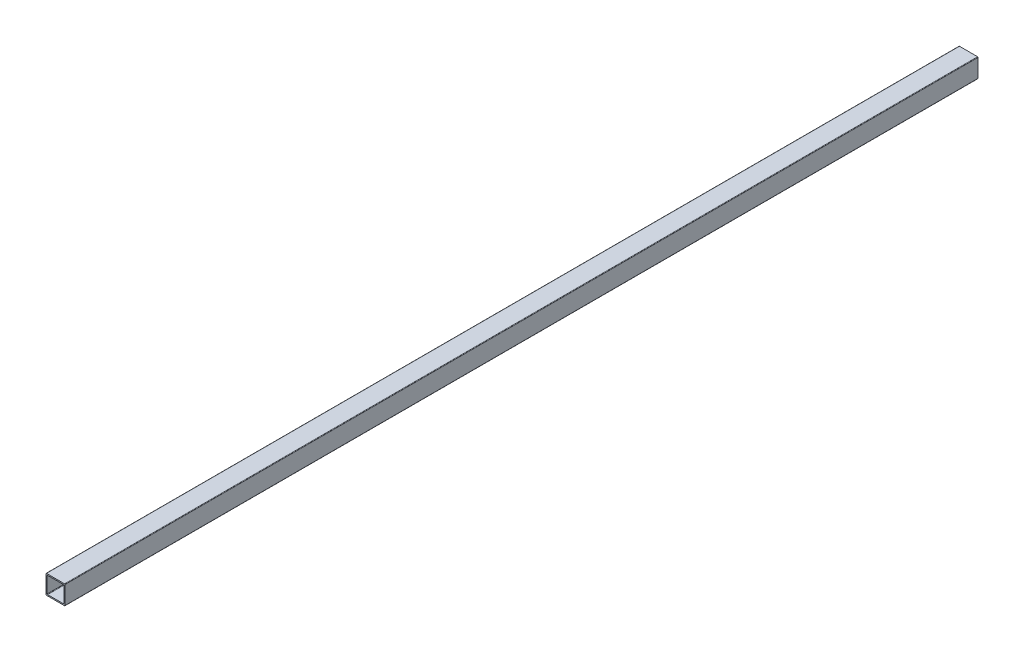
ISO-10303-21;
HEADER;
FILE_DESCRIPTION(('STEP AP214'),'2;1');
FILE_NAME('part.step','',(''),(''),'','','');
FILE_SCHEMA(('AUTOMOTIVE_DESIGN { 1 0 10303 214 1 1 1 1 }'));
ENDSEC;
DATA;
#1=APPLICATION_CONTEXT('core data for automotive mechanical design processes');
#2=APPLICATION_PROTOCOL_DEFINITION('international standard','automotive_design',2000,#1);
#3=PRODUCT_CONTEXT('',#1,'mechanical');
#4=PRODUCT('Part','Part','',(#3));
#5=PRODUCT_RELATED_PRODUCT_CATEGORY('part','',(#4));
#6=PRODUCT_DEFINITION_FORMATION('','',#4);
#7=PRODUCT_DEFINITION_CONTEXT('part definition',#1,'design');
#8=PRODUCT_DEFINITION('design','',#6,#7);
#9=PRODUCT_DEFINITION_SHAPE('','',#8);
#10=(LENGTH_UNIT() NAMED_UNIT(*) SI_UNIT(.MILLI.,.METRE.));
#11=(NAMED_UNIT(*) PLANE_ANGLE_UNIT() SI_UNIT($,.RADIAN.));
#12=(NAMED_UNIT(*) SI_UNIT($,.STERADIAN.) SOLID_ANGLE_UNIT());
#13=UNCERTAINTY_MEASURE_WITH_UNIT(LENGTH_MEASURE(1.E-05),#10,'distance_accuracy_value','');
#14=(GEOMETRIC_REPRESENTATION_CONTEXT(3) GLOBAL_UNCERTAINTY_ASSIGNED_CONTEXT((#13)) GLOBAL_UNIT_ASSIGNED_CONTEXT((#10,
#11,#12)) REPRESENTATION_CONTEXT('',''));
#15=CARTESIAN_POINT('',(0.,0.,0.));
#16=DIRECTION('',(0.,0.,1.));
#17=DIRECTION('',(1.,0.,0.));
#18=AXIS2_PLACEMENT_3D('',#15,#16,#17);
#19=CARTESIAN_POINT('',(12.065,-12.065,1219.2));
#20=DIRECTION('',(0.,0.,-1.));
#21=DIRECTION('',(-1.,0.,0.));
#22=AXIS2_PLACEMENT_3D('',#19,#20,#21);
#23=CYLINDRICAL_SURFACE('',#22,0.634999999999999);
#24=CARTESIAN_POINT('',(12.065,-12.065,0.));
#25=DIRECTION('',(0.,0.,1.));
#26=DIRECTION('',(1.,0.,0.));
#27=AXIS2_PLACEMENT_3D('',#24,#25,#26);
#28=CIRCLE('',#27,0.634999999999999);
#29=CARTESIAN_POINT('',(12.065,-12.7,0.));
#30=VERTEX_POINT('',#29);
#31=CARTESIAN_POINT('',(12.7,-12.065,0.));
#32=VERTEX_POINT('',#31);
#33=EDGE_CURVE('E234',#30,#32,#28,.T.);
#34=ORIENTED_EDGE('',*,*,#33,.T.);
#35=DIRECTION('',(0.,0.,-1.));
#36=VECTOR('',#35,1.);
#37=CARTESIAN_POINT('',(12.7,-12.065,1219.2));
#38=LINE('',#37,#36);
#39=CARTESIAN_POINT('',(12.7,-12.065,1219.2));
#40=VERTEX_POINT('',#39);
#41=EDGE_CURVE('E12',#40,#32,#38,.T.);
#42=ORIENTED_EDGE('',*,*,#41,.F.);
#43=CARTESIAN_POINT('',(12.065,-12.065,1219.2));
#44=DIRECTION('',(0.,0.,1.));
#45=DIRECTION('',(1.,0.,0.));
#46=AXIS2_PLACEMENT_3D('',#43,#44,#45);
#47=CIRCLE('',#46,0.634999999999999);
#48=CARTESIAN_POINT('',(12.065,-12.7,1219.2));
#49=VERTEX_POINT('',#48);
#50=EDGE_CURVE('E312',#49,#40,#47,.T.);
#51=ORIENTED_EDGE('',*,*,#50,.F.);
#52=DIRECTION('',(0.,0.,-1.));
#53=VECTOR('',#52,1.);
#54=CARTESIAN_POINT('',(12.065,-12.7,1219.2));
#55=LINE('',#54,#53);
#56=EDGE_CURVE('E249',#49,#30,#55,.T.);
#57=ORIENTED_EDGE('',*,*,#56,.T.);
#58=EDGE_LOOP('',(#34,#42,#51,#57));
#59=FACE_BOUND('',#58,.T.);
#60=ADVANCED_FACE('F62',(#59),#23,.T.);
#61=CARTESIAN_POINT('',(12.7,-12.065,1219.2));
#62=DIRECTION('',(-1.,0.,0.));
#63=DIRECTION('',(0.,0.,1.));
#64=AXIS2_PLACEMENT_3D('',#61,#62,#63);
#65=PLANE('',#64);
#66=DIRECTION('',(0.,1.,0.));
#67=VECTOR('',#66,1.);
#68=CARTESIAN_POINT('',(12.7,-12.065,0.));
#69=LINE('',#68,#67);
#70=CARTESIAN_POINT('',(12.7,12.065,0.));
#71=VERTEX_POINT('',#70);
#72=EDGE_CURVE('E237',#32,#71,#69,.T.);
#73=ORIENTED_EDGE('',*,*,#72,.T.);
#74=DIRECTION('',(0.,0.,-1.));
#75=VECTOR('',#74,1.);
#76=CARTESIAN_POINT('',(12.7,12.065,1219.2));
#77=LINE('',#76,#75);
#78=CARTESIAN_POINT('',(12.7,12.065,1219.2));
#79=VERTEX_POINT('',#78);
#80=EDGE_CURVE('E72',#79,#71,#77,.T.);
#81=ORIENTED_EDGE('',*,*,#80,.F.);
#82=DIRECTION('',(0.,1.,0.));
#83=VECTOR('',#82,1.);
#84=CARTESIAN_POINT('',(12.7,-12.065,1219.2));
#85=LINE('',#84,#83);
#86=EDGE_CURVE('E314',#40,#79,#85,.T.);
#87=ORIENTED_EDGE('',*,*,#86,.F.);
#88=ORIENTED_EDGE('',*,*,#41,.T.);
#89=EDGE_LOOP('',(#73,#81,#87,#88));
#90=FACE_BOUND('',#89,.T.);
#91=ADVANCED_FACE('F349',(#90),#65,.F.);
#92=CARTESIAN_POINT('',(12.065,12.065,1219.2));
#93=DIRECTION('',(0.,0.,-1.));
#94=DIRECTION('',(-1.,0.,0.));
#95=AXIS2_PLACEMENT_3D('',#92,#93,#94);
#96=CYLINDRICAL_SURFACE('',#95,0.635);
#97=CARTESIAN_POINT('',(12.065,12.065,0.));
#98=DIRECTION('',(0.,0.,1.));
#99=DIRECTION('',(1.,0.,0.));
#100=AXIS2_PLACEMENT_3D('',#97,#98,#99);
#101=CIRCLE('',#100,0.635);
#102=CARTESIAN_POINT('',(12.065,12.7,0.));
#103=VERTEX_POINT('',#102);
#104=EDGE_CURVE('E239',#71,#103,#101,.T.);
#105=ORIENTED_EDGE('',*,*,#104,.T.);
#106=DIRECTION('',(0.,0.,-1.));
#107=VECTOR('',#106,1.);
#108=CARTESIAN_POINT('',(12.065,12.7,1219.2));
#109=LINE('',#108,#107);
#110=CARTESIAN_POINT('',(12.065,12.7,1219.2));
#111=VERTEX_POINT('',#110);
#112=EDGE_CURVE('E256',#111,#103,#109,.T.);
#113=ORIENTED_EDGE('',*,*,#112,.F.);
#114=CARTESIAN_POINT('',(12.065,12.065,1219.2));
#115=DIRECTION('',(0.,0.,1.));
#116=DIRECTION('',(1.,0.,0.));
#117=AXIS2_PLACEMENT_3D('',#114,#115,#116);
#118=CIRCLE('',#117,0.635);
#119=EDGE_CURVE('E316',#79,#111,#118,.T.);
#120=ORIENTED_EDGE('',*,*,#119,.F.);
#121=ORIENTED_EDGE('',*,*,#80,.T.);
#122=EDGE_LOOP('',(#105,#113,#120,#121));
#123=FACE_BOUND('',#122,.T.);
#124=ADVANCED_FACE('F354',(#123),#96,.T.);
#125=CARTESIAN_POINT('',(12.065,12.7,1219.2));
#126=DIRECTION('',(0.,-1.,0.));
#127=DIRECTION('',(1.,0.,0.));
#128=AXIS2_PLACEMENT_3D('',#125,#126,#127);
#129=PLANE('',#128);
#130=DIRECTION('',(-1.,0.,0.));
#131=VECTOR('',#130,1.);
#132=CARTESIAN_POINT('',(12.065,12.7,0.));
#133=LINE('',#132,#131);
#134=CARTESIAN_POINT('',(-12.065,12.7,0.));
#135=VERTEX_POINT('',#134);
#136=EDGE_CURVE('E241',#103,#135,#133,.T.);
#137=ORIENTED_EDGE('',*,*,#136,.T.);
#138=DIRECTION('',(0.,0.,-1.));
#139=VECTOR('',#138,1.);
#140=CARTESIAN_POINT('',(-12.065,12.7,1219.2));
#141=LINE('',#140,#139);
#142=CARTESIAN_POINT('',(-12.065,12.7,1219.2));
#143=VERTEX_POINT('',#142);
#144=EDGE_CURVE('E253',#143,#135,#141,.T.);
#145=ORIENTED_EDGE('',*,*,#144,.F.);
#146=DIRECTION('',(-1.,0.,0.));
#147=VECTOR('',#146,1.);
#148=CARTESIAN_POINT('',(12.065,12.7,1219.2));
#149=LINE('',#148,#147);
#150=EDGE_CURVE('E318',#111,#143,#149,.T.);
#151=ORIENTED_EDGE('',*,*,#150,.F.);
#152=ORIENTED_EDGE('',*,*,#112,.T.);
#153=EDGE_LOOP('',(#137,#145,#151,#152));
#154=FACE_BOUND('',#153,.T.);
#155=ADVANCED_FACE('F324',(#154),#129,.F.);
#156=CARTESIAN_POINT('',(-12.065,12.065,1219.2));
#157=DIRECTION('',(0.,0.,-1.));
#158=DIRECTION('',(-1.,0.,0.));
#159=AXIS2_PLACEMENT_3D('',#156,#157,#158);
#160=CYLINDRICAL_SURFACE('',#159,0.635);
#161=CARTESIAN_POINT('',(-12.065,12.065,0.));
#162=DIRECTION('',(0.,0.,1.));
#163=DIRECTION('',(1.,0.,0.));
#164=AXIS2_PLACEMENT_3D('',#161,#162,#163);
#165=CIRCLE('',#164,0.635);
#166=CARTESIAN_POINT('',(-12.7,12.065,0.));
#167=VERTEX_POINT('',#166);
#168=EDGE_CURVE('E243',#135,#167,#165,.T.);
#169=ORIENTED_EDGE('',*,*,#168,.T.);
#170=DIRECTION('',(0.,0.,-1.));
#171=VECTOR('',#170,1.);
#172=CARTESIAN_POINT('',(-12.7,12.065,1219.2));
#173=LINE('',#172,#171);
#174=CARTESIAN_POINT('',(-12.7,12.065,1219.2));
#175=VERTEX_POINT('',#174);
#176=EDGE_CURVE('E201',#175,#167,#173,.T.);
#177=ORIENTED_EDGE('',*,*,#176,.F.);
#178=CARTESIAN_POINT('',(-12.065,12.065,1219.2));
#179=DIRECTION('',(0.,0.,1.));
#180=DIRECTION('',(1.,0.,0.));
#181=AXIS2_PLACEMENT_3D('',#178,#179,#180);
#182=CIRCLE('',#181,0.635);
#183=EDGE_CURVE('E192',#143,#175,#182,.T.);
#184=ORIENTED_EDGE('',*,*,#183,.F.);
#185=ORIENTED_EDGE('',*,*,#144,.T.);
#186=EDGE_LOOP('',(#169,#177,#184,#185));
#187=FACE_BOUND('',#186,.T.);
#188=ADVANCED_FACE('F328',(#187),#160,.T.);
#189=CARTESIAN_POINT('',(-12.7,-12.065,1219.2));
#190=DIRECTION('',(1.,0.,0.));
#191=DIRECTION('',(0.,0.,-1.));
#192=AXIS2_PLACEMENT_3D('',#189,#190,#191);
#193=PLANE('',#192);
#194=DIRECTION('',(0.,-1.,0.));
#195=VECTOR('',#194,1.);
#196=CARTESIAN_POINT('',(-12.7,-12.065,0.));
#197=LINE('',#196,#195);
#198=CARTESIAN_POINT('',(-12.7,-12.065,0.));
#199=VERTEX_POINT('',#198);
#200=EDGE_CURVE('E200',#167,#199,#197,.T.);
#201=ORIENTED_EDGE('',*,*,#200,.T.);
#202=DIRECTION('',(0.,0.,-1.));
#203=VECTOR('',#202,1.);
#204=CARTESIAN_POINT('',(-12.7,-12.065,1219.2));
#205=LINE('',#204,#203);
#206=CARTESIAN_POINT('',(-12.7,-12.065,1219.2));
#207=VERTEX_POINT('',#206);
#208=EDGE_CURVE('E197',#207,#199,#205,.T.);
#209=ORIENTED_EDGE('',*,*,#208,.F.);
#210=DIRECTION('',(0.,-1.,0.));
#211=VECTOR('',#210,1.);
#212=CARTESIAN_POINT('',(-12.7,-12.065,1219.2));
#213=LINE('',#212,#211);
#214=EDGE_CURVE('E186',#175,#207,#213,.T.);
#215=ORIENTED_EDGE('',*,*,#214,.F.);
#216=ORIENTED_EDGE('',*,*,#176,.T.);
#217=EDGE_LOOP('',(#201,#209,#215,#216));
#218=FACE_BOUND('',#217,.T.);
#219=ADVANCED_FACE('F198',(#218),#193,.F.);
#220=CARTESIAN_POINT('',(-12.065,-12.065,1219.2));
#221=DIRECTION('',(0.,0.,-1.));
#222=DIRECTION('',(-1.,0.,0.));
#223=AXIS2_PLACEMENT_3D('',#220,#221,#222);
#224=CYLINDRICAL_SURFACE('',#223,0.634999999999999);
#225=CARTESIAN_POINT('',(-12.065,-12.065,0.));
#226=DIRECTION('',(0.,0.,1.));
#227=DIRECTION('',(-1.,0.,0.));
#228=AXIS2_PLACEMENT_3D('',#225,#226,#227);
#229=CIRCLE('',#228,0.634999999999999);
#230=CARTESIAN_POINT('',(-12.065,-12.7,0.));
#231=VERTEX_POINT('',#230);
#232=EDGE_CURVE('E134',#199,#231,#229,.T.);
#233=ORIENTED_EDGE('',*,*,#232,.T.);
#234=DIRECTION('',(0.,0.,-1.));
#235=VECTOR('',#234,1.);
#236=CARTESIAN_POINT('',(-12.065,-12.7,1219.2));
#237=LINE('',#236,#235);
#238=CARTESIAN_POINT('',(-12.065,-12.7,1219.2));
#239=VERTEX_POINT('',#238);
#240=EDGE_CURVE('E202',#239,#231,#237,.T.);
#241=ORIENTED_EDGE('',*,*,#240,.F.);
#242=CARTESIAN_POINT('',(-12.065,-12.065,1219.2));
#243=DIRECTION('',(0.,0.,1.));
#244=DIRECTION('',(-1.,0.,0.));
#245=AXIS2_PLACEMENT_3D('',#242,#243,#244);
#246=CIRCLE('',#245,0.634999999999999);
#247=EDGE_CURVE('E190',#207,#239,#246,.T.);
#248=ORIENTED_EDGE('',*,*,#247,.F.);
#249=ORIENTED_EDGE('',*,*,#208,.T.);
#250=EDGE_LOOP('',(#233,#241,#248,#249));
#251=FACE_BOUND('',#250,.T.);
#252=ADVANCED_FACE('F204',(#251),#224,.T.);
#253=CARTESIAN_POINT('',(-10.4775,10.4775,1219.2));
#254=DIRECTION('',(0.,0.,-1.));
#255=DIRECTION('',(-1.,0.,0.));
#256=AXIS2_PLACEMENT_3D('',#253,#254,#255);
#257=CYLINDRICAL_SURFACE('',#256,0.635);
#258=CARTESIAN_POINT('',(-10.4775,10.4775,0.));
#259=DIRECTION('',(0.,0.,1.));
#260=DIRECTION('',(-1.,0.,0.));
#261=AXIS2_PLACEMENT_3D('',#258,#259,#260);
#262=CIRCLE('',#261,0.635);
#263=CARTESIAN_POINT('',(-10.4775,11.1125,0.));
#264=VERTEX_POINT('',#263);
#265=CARTESIAN_POINT('',(-11.1125,10.4775,0.));
#266=VERTEX_POINT('',#265);
#267=EDGE_CURVE('E210',#264,#266,#262,.T.);
#268=ORIENTED_EDGE('',*,*,#267,.F.);
#269=DIRECTION('',(0.,0.,-1.));
#270=VECTOR('',#269,1.);
#271=CARTESIAN_POINT('',(-10.4775,11.1125,1219.2));
#272=LINE('',#271,#270);
#273=CARTESIAN_POINT('',(-10.4775,11.1125,1219.2));
#274=VERTEX_POINT('',#273);
#275=EDGE_CURVE('E66',#274,#264,#272,.T.);
#276=ORIENTED_EDGE('',*,*,#275,.F.);
#277=CARTESIAN_POINT('',(-10.4775,10.4775,1219.2));
#278=DIRECTION('',(0.,0.,1.));
#279=DIRECTION('',(-1.,0.,0.));
#280=AXIS2_PLACEMENT_3D('',#277,#278,#279);
#281=CIRCLE('',#280,0.635);
#282=CARTESIAN_POINT('',(-11.1125,10.4775,1219.2));
#283=VERTEX_POINT('',#282);
#284=EDGE_CURVE('E248',#274,#283,#281,.T.);
#285=ORIENTED_EDGE('',*,*,#284,.T.);
#286=DIRECTION('',(0.,0.,-1.));
#287=VECTOR('',#286,1.);
#288=CARTESIAN_POINT('',(-11.1125,10.4775,1219.2));
#289=LINE('',#288,#287);
#290=EDGE_CURVE('E206',#283,#266,#289,.T.);
#291=ORIENTED_EDGE('',*,*,#290,.T.);
#292=EDGE_LOOP('',(#268,#276,#285,#291));
#293=FACE_BOUND('',#292,.T.);
#294=ADVANCED_FACE('F64',(#293),#257,.F.);
#295=CARTESIAN_POINT('',(10.4775,11.1125,1219.2));
#296=DIRECTION('',(0.,-1.,0.));
#297=DIRECTION('',(1.,0.,0.));
#298=AXIS2_PLACEMENT_3D('',#295,#296,#297);
#299=PLANE('',#298);
#300=DIRECTION('',(-1.,0.,0.));
#301=VECTOR('',#300,1.);
#302=CARTESIAN_POINT('',(10.4775,11.1125,0.));
#303=LINE('',#302,#301);
#304=CARTESIAN_POINT('',(10.4775,11.1125,0.));
#305=VERTEX_POINT('',#304);
#306=EDGE_CURVE('E213',#305,#264,#303,.T.);
#307=ORIENTED_EDGE('',*,*,#306,.F.);
#308=DIRECTION('',(0.,0.,-1.));
#309=VECTOR('',#308,1.);
#310=CARTESIAN_POINT('',(10.4775,11.1125,1219.2));
#311=LINE('',#310,#309);
#312=CARTESIAN_POINT('',(10.4775,11.1125,1219.2));
#313=VERTEX_POINT('',#312);
#314=EDGE_CURVE('E271',#313,#305,#311,.T.);
#315=ORIENTED_EDGE('',*,*,#314,.F.);
#316=DIRECTION('',(-1.,0.,0.));
#317=VECTOR('',#316,1.);
#318=CARTESIAN_POINT('',(10.4775,11.1125,1219.2));
#319=LINE('',#318,#317);
#320=EDGE_CURVE('E280',#313,#274,#319,.T.);
#321=ORIENTED_EDGE('',*,*,#320,.T.);
#322=ORIENTED_EDGE('',*,*,#275,.T.);
#323=EDGE_LOOP('',(#307,#315,#321,#322));
#324=FACE_BOUND('',#323,.T.);
#325=ADVANCED_FACE('F278',(#324),#299,.T.);
#326=CARTESIAN_POINT('',(10.4775,10.4775,1219.2));
#327=DIRECTION('',(0.,0.,-1.));
#328=DIRECTION('',(-1.,0.,0.));
#329=AXIS2_PLACEMENT_3D('',#326,#327,#328);
#330=CYLINDRICAL_SURFACE('',#329,0.635);
#331=CARTESIAN_POINT('',(10.4775,10.4775,0.));
#332=DIRECTION('',(0.,0.,1.));
#333=DIRECTION('',(-1.,0.,0.));
#334=AXIS2_PLACEMENT_3D('',#331,#332,#333);
#335=CIRCLE('',#334,0.635);
#336=CARTESIAN_POINT('',(11.1125,10.4775,0.));
#337=VERTEX_POINT('',#336);
#338=EDGE_CURVE('E216',#337,#305,#335,.T.);
#339=ORIENTED_EDGE('',*,*,#338,.F.);
#340=DIRECTION('',(0.,0.,-1.));
#341=VECTOR('',#340,1.);
#342=CARTESIAN_POINT('',(11.1125,10.4775,1219.2));
#343=LINE('',#342,#341);
#344=CARTESIAN_POINT('',(11.1125,10.4775,1219.2));
#345=VERTEX_POINT('',#344);
#346=EDGE_CURVE('E270',#345,#337,#343,.T.);
#347=ORIENTED_EDGE('',*,*,#346,.F.);
#348=CARTESIAN_POINT('',(10.4775,10.4775,1219.2));
#349=DIRECTION('',(0.,0.,1.));
#350=DIRECTION('',(-1.,0.,0.));
#351=AXIS2_PLACEMENT_3D('',#348,#349,#350);
#352=CIRCLE('',#351,0.635);
#353=EDGE_CURVE('E288',#345,#313,#352,.T.);
#354=ORIENTED_EDGE('',*,*,#353,.T.);
#355=ORIENTED_EDGE('',*,*,#314,.T.);
#356=EDGE_LOOP('',(#339,#347,#354,#355));
#357=FACE_BOUND('',#356,.T.);
#358=ADVANCED_FACE('F286',(#357),#330,.F.);
#359=CARTESIAN_POINT('',(11.1125,-10.4775,1219.2));
#360=DIRECTION('',(-1.,0.,0.));
#361=DIRECTION('',(0.,0.,1.));
#362=AXIS2_PLACEMENT_3D('',#359,#360,#361);
#363=PLANE('',#362);
#364=DIRECTION('',(0.,1.,0.));
#365=VECTOR('',#364,1.);
#366=CARTESIAN_POINT('',(11.1125,-10.4775,0.));
#367=LINE('',#366,#365);
#368=CARTESIAN_POINT('',(11.1125,-10.4775,0.));
#369=VERTEX_POINT('',#368);
#370=EDGE_CURVE('E219',#369,#337,#367,.T.);
#371=ORIENTED_EDGE('',*,*,#370,.F.);
#372=DIRECTION('',(0.,0.,-1.));
#373=VECTOR('',#372,1.);
#374=CARTESIAN_POINT('',(11.1125,-10.4775,1219.2));
#375=LINE('',#374,#373);
#376=CARTESIAN_POINT('',(11.1125,-10.4775,1219.2));
#377=VERTEX_POINT('',#376);
#378=EDGE_CURVE('E268',#377,#369,#375,.T.);
#379=ORIENTED_EDGE('',*,*,#378,.F.);
#380=DIRECTION('',(0.,1.,0.));
#381=VECTOR('',#380,1.);
#382=CARTESIAN_POINT('',(11.1125,-10.4775,1219.2));
#383=LINE('',#382,#381);
#384=EDGE_CURVE('E294',#377,#345,#383,.T.);
#385=ORIENTED_EDGE('',*,*,#384,.T.);
#386=ORIENTED_EDGE('',*,*,#346,.T.);
#387=EDGE_LOOP('',(#371,#379,#385,#386));
#388=FACE_BOUND('',#387,.T.);
#389=ADVANCED_FACE('F297',(#388),#363,.T.);
#390=CARTESIAN_POINT('',(10.4775,-10.4775,1219.2));
#391=DIRECTION('',(0.,0.,-1.));
#392=DIRECTION('',(-1.,0.,0.));
#393=AXIS2_PLACEMENT_3D('',#390,#391,#392);
#394=CYLINDRICAL_SURFACE('',#393,0.635);
#395=CARTESIAN_POINT('',(10.4775,-10.4775,0.));
#396=DIRECTION('',(0.,0.,1.));
#397=DIRECTION('',(-1.,0.,0.));
#398=AXIS2_PLACEMENT_3D('',#395,#396,#397);
#399=CIRCLE('',#398,0.635);
#400=CARTESIAN_POINT('',(10.4775,-11.1125,0.));
#401=VERTEX_POINT('',#400);
#402=EDGE_CURVE('E222',#401,#369,#399,.T.);
#403=ORIENTED_EDGE('',*,*,#402,.F.);
#404=DIRECTION('',(0.,0.,-1.));
#405=VECTOR('',#404,1.);
#406=CARTESIAN_POINT('',(10.4775,-11.1125,1219.2));
#407=LINE('',#406,#405);
#408=CARTESIAN_POINT('',(10.4775,-11.1125,1219.2));
#409=VERTEX_POINT('',#408);
#410=EDGE_CURVE('E266',#409,#401,#407,.T.);
#411=ORIENTED_EDGE('',*,*,#410,.F.);
#412=CARTESIAN_POINT('',(10.4775,-10.4775,1219.2));
#413=DIRECTION('',(0.,0.,1.));
#414=DIRECTION('',(-1.,0.,0.));
#415=AXIS2_PLACEMENT_3D('',#412,#413,#414);
#416=CIRCLE('',#415,0.635);
#417=EDGE_CURVE('E298',#409,#377,#416,.T.);
#418=ORIENTED_EDGE('',*,*,#417,.T.);
#419=ORIENTED_EDGE('',*,*,#378,.T.);
#420=EDGE_LOOP('',(#403,#411,#418,#419));
#421=FACE_BOUND('',#420,.T.);
#422=ADVANCED_FACE('F365',(#421),#394,.F.);
#423=CARTESIAN_POINT('',(10.4775,-11.1125,1219.2));
#424=DIRECTION('',(0.,1.,0.));
#425=DIRECTION('',(-1.,0.,0.));
#426=AXIS2_PLACEMENT_3D('',#423,#424,#425);
#427=PLANE('',#426);
#428=DIRECTION('',(1.,0.,0.));
#429=VECTOR('',#428,1.);
#430=CARTESIAN_POINT('',(10.4775,-11.1125,0.));
#431=LINE('',#430,#429);
#432=CARTESIAN_POINT('',(-10.4775,-11.1125,0.));
#433=VERTEX_POINT('',#432);
#434=EDGE_CURVE('E225',#433,#401,#431,.T.);
#435=ORIENTED_EDGE('',*,*,#434,.F.);
#436=DIRECTION('',(0.,0.,-1.));
#437=VECTOR('',#436,1.);
#438=CARTESIAN_POINT('',(-10.4775,-11.1125,1219.2));
#439=LINE('',#438,#437);
#440=CARTESIAN_POINT('',(-10.4775,-11.1125,1219.2));
#441=VERTEX_POINT('',#440);
#442=EDGE_CURVE('E264',#441,#433,#439,.T.);
#443=ORIENTED_EDGE('',*,*,#442,.F.);
#444=DIRECTION('',(1.,0.,0.));
#445=VECTOR('',#444,1.);
#446=CARTESIAN_POINT('',(10.4775,-11.1125,1219.2));
#447=LINE('',#446,#445);
#448=EDGE_CURVE('E300',#441,#409,#447,.T.);
#449=ORIENTED_EDGE('',*,*,#448,.T.);
#450=ORIENTED_EDGE('',*,*,#410,.T.);
#451=EDGE_LOOP('',(#435,#443,#449,#450));
#452=FACE_BOUND('',#451,.T.);
#453=ADVANCED_FACE('F361',(#452),#427,.T.);
#454=CARTESIAN_POINT('',(-10.4775,-10.4775,1219.2));
#455=DIRECTION('',(0.,0.,-1.));
#456=DIRECTION('',(-1.,0.,0.));
#457=AXIS2_PLACEMENT_3D('',#454,#455,#456);
#458=CYLINDRICAL_SURFACE('',#457,0.635);
#459=CARTESIAN_POINT('',(-10.4775,-10.4775,0.));
#460=DIRECTION('',(0.,0.,1.));
#461=DIRECTION('',(1.,0.,0.));
#462=AXIS2_PLACEMENT_3D('',#459,#460,#461);
#463=CIRCLE('',#462,0.635);
#464=CARTESIAN_POINT('',(-11.1125,-10.4775,0.));
#465=VERTEX_POINT('',#464);
#466=EDGE_CURVE('E228',#465,#433,#463,.T.);
#467=ORIENTED_EDGE('',*,*,#466,.F.);
#468=DIRECTION('',(0.,0.,-1.));
#469=VECTOR('',#468,1.);
#470=CARTESIAN_POINT('',(-11.1125,-10.4775,1219.2));
#471=LINE('',#470,#469);
#472=CARTESIAN_POINT('',(-11.1125,-10.4775,1219.2));
#473=VERTEX_POINT('',#472);
#474=EDGE_CURVE('E262',#473,#465,#471,.T.);
#475=ORIENTED_EDGE('',*,*,#474,.F.);
#476=CARTESIAN_POINT('',(-10.4775,-10.4775,1219.2));
#477=DIRECTION('',(0.,0.,1.));
#478=DIRECTION('',(1.,0.,0.));
#479=AXIS2_PLACEMENT_3D('',#476,#477,#478);
#480=CIRCLE('',#479,0.635);
#481=EDGE_CURVE('E306',#473,#441,#480,.T.);
#482=ORIENTED_EDGE('',*,*,#481,.T.);
#483=ORIENTED_EDGE('',*,*,#442,.T.);
#484=EDGE_LOOP('',(#467,#475,#482,#483));
#485=FACE_BOUND('',#484,.T.);
#486=ADVANCED_FACE('F343',(#485),#458,.F.);
#487=CARTESIAN_POINT('',(-11.1125,-10.4775,1219.2));
#488=DIRECTION('',(1.,0.,0.));
#489=DIRECTION('',(0.,0.,-1.));
#490=AXIS2_PLACEMENT_3D('',#487,#488,#489);
#491=PLANE('',#490);
#492=DIRECTION('',(0.,-1.,0.));
#493=VECTOR('',#492,1.);
#494=CARTESIAN_POINT('',(-11.1125,-10.4775,0.));
#495=LINE('',#494,#493);
#496=EDGE_CURVE('E231',#266,#465,#495,.T.);
#497=ORIENTED_EDGE('',*,*,#496,.F.);
#498=ORIENTED_EDGE('',*,*,#290,.F.);
#499=DIRECTION('',(0.,-1.,0.));
#500=VECTOR('',#499,1.);
#501=CARTESIAN_POINT('',(-11.1125,-10.4775,1219.2));
#502=LINE('',#501,#500);
#503=EDGE_CURVE('E309',#283,#473,#502,.T.);
#504=ORIENTED_EDGE('',*,*,#503,.T.);
#505=ORIENTED_EDGE('',*,*,#474,.T.);
#506=EDGE_LOOP('',(#497,#498,#504,#505));
#507=FACE_BOUND('',#506,.T.);
#508=ADVANCED_FACE('F336',(#507),#491,.T.);
#509=CARTESIAN_POINT('',(12.065,-12.7,1219.2));
#510=DIRECTION('',(0.,1.,0.));
#511=DIRECTION('',(-1.,0.,0.));
#512=AXIS2_PLACEMENT_3D('',#509,#510,#511);
#513=PLANE('',#512);
#514=DIRECTION('',(1.,0.,0.));
#515=VECTOR('',#514,1.);
#516=CARTESIAN_POINT('',(12.065,-12.7,0.));
#517=LINE('',#516,#515);
#518=EDGE_CURVE('E140',#231,#30,#517,.T.);
#519=ORIENTED_EDGE('',*,*,#518,.T.);
#520=ORIENTED_EDGE('',*,*,#56,.F.);
#521=DIRECTION('',(1.,0.,0.));
#522=VECTOR('',#521,1.);
#523=CARTESIAN_POINT('',(12.065,-12.7,1219.2));
#524=LINE('',#523,#522);
#525=EDGE_CURVE('E81',#239,#49,#524,.T.);
#526=ORIENTED_EDGE('',*,*,#525,.F.);
#527=ORIENTED_EDGE('',*,*,#240,.T.);
#528=EDGE_LOOP('',(#519,#520,#526,#527));
#529=FACE_BOUND('',#528,.T.);
#530=ADVANCED_FACE('F334',(#529),#513,.F.);
#531=CARTESIAN_POINT('',(12.065,-12.065,1219.2));
#532=DIRECTION('',(0.,0.,1.));
#533=DIRECTION('',(1.,0.,0.));
#534=AXIS2_PLACEMENT_3D('',#531,#532,#533);
#535=PLANE('',#534);
#536=ORIENTED_EDGE('',*,*,#284,.F.);
#537=ORIENTED_EDGE('',*,*,#320,.F.);
#538=ORIENTED_EDGE('',*,*,#353,.F.);
#539=ORIENTED_EDGE('',*,*,#384,.F.);
#540=ORIENTED_EDGE('',*,*,#417,.F.);
#541=ORIENTED_EDGE('',*,*,#448,.F.);
#542=ORIENTED_EDGE('',*,*,#481,.F.);
#543=ORIENTED_EDGE('',*,*,#503,.F.);
#544=EDGE_LOOP('',(#536,#537,#538,#539,#540,#541,#542,#543));
#545=FACE_BOUND('',#544,.T.);
#546=ORIENTED_EDGE('',*,*,#50,.T.);
#547=ORIENTED_EDGE('',*,*,#86,.T.);
#548=ORIENTED_EDGE('',*,*,#119,.T.);
#549=ORIENTED_EDGE('',*,*,#150,.T.);
#550=ORIENTED_EDGE('',*,*,#183,.T.);
#551=ORIENTED_EDGE('',*,*,#214,.T.);
#552=ORIENTED_EDGE('',*,*,#247,.T.);
#553=ORIENTED_EDGE('',*,*,#525,.T.);
#554=EDGE_LOOP('',(#546,#547,#548,#549,#550,#551,#552,#553));
#555=FACE_BOUND('',#554,.T.);
#556=ADVANCED_FACE('F188',(#545,#555),#535,.T.);
#557=CARTESIAN_POINT('',(12.065,-12.065,0.));
#558=DIRECTION('',(0.,0.,1.));
#559=DIRECTION('',(1.,0.,0.));
#560=AXIS2_PLACEMENT_3D('',#557,#558,#559);
#561=PLANE('',#560);
#562=ORIENTED_EDGE('',*,*,#267,.T.);
#563=ORIENTED_EDGE('',*,*,#496,.T.);
#564=ORIENTED_EDGE('',*,*,#466,.T.);
#565=ORIENTED_EDGE('',*,*,#434,.T.);
#566=ORIENTED_EDGE('',*,*,#402,.T.);
#567=ORIENTED_EDGE('',*,*,#370,.T.);
#568=ORIENTED_EDGE('',*,*,#338,.T.);
#569=ORIENTED_EDGE('',*,*,#306,.T.);
#570=EDGE_LOOP('',(#562,#563,#564,#565,#566,#567,#568,#569));
#571=FACE_BOUND('',#570,.T.);
#572=ORIENTED_EDGE('',*,*,#33,.F.);
#573=ORIENTED_EDGE('',*,*,#518,.F.);
#574=ORIENTED_EDGE('',*,*,#232,.F.);
#575=ORIENTED_EDGE('',*,*,#200,.F.);
#576=ORIENTED_EDGE('',*,*,#168,.F.);
#577=ORIENTED_EDGE('',*,*,#136,.F.);
#578=ORIENTED_EDGE('',*,*,#104,.F.);
#579=ORIENTED_EDGE('',*,*,#72,.F.);
#580=EDGE_LOOP('',(#572,#573,#574,#575,#576,#577,#578,#579));
#581=FACE_BOUND('',#580,.T.);
#582=ADVANCED_FACE('F283',(#571,#581),#561,.F.);
#583=CLOSED_SHELL('',(#60,#91,#124,#155,#188,#219,#252,#294,#325,#358,#389,#422,#453,#486,#508,
#530,#556,#582));
#584=MANIFOLD_SOLID_BREP('B2',#583);
#585=ADVANCED_BREP_SHAPE_REPRESENTATION('',(#18,#584),#14);
#586=SHAPE_DEFINITION_REPRESENTATION(#9,#585);
ENDSEC;
END-ISO-10303-21;
